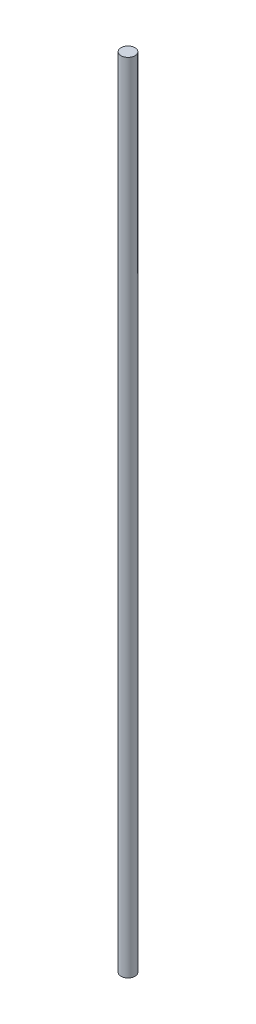
ISO-10303-21;
HEADER;
FILE_DESCRIPTION(('STEP AP214'),'2;1');
FILE_NAME('part.step','',(''),(''),'','','');
FILE_SCHEMA(('AUTOMOTIVE_DESIGN { 1 0 10303 214 1 1 1 1 }'));
ENDSEC;
DATA;
#1=APPLICATION_CONTEXT('core data for automotive mechanical design processes');
#2=APPLICATION_PROTOCOL_DEFINITION('international standard','automotive_design',2000,#1);
#3=PRODUCT_CONTEXT('',#1,'mechanical');
#4=PRODUCT('Part','Part','',(#3));
#5=PRODUCT_RELATED_PRODUCT_CATEGORY('part','',(#4));
#6=PRODUCT_DEFINITION_FORMATION('','',#4);
#7=PRODUCT_DEFINITION_CONTEXT('part definition',#1,'design');
#8=PRODUCT_DEFINITION('design','',#6,#7);
#9=PRODUCT_DEFINITION_SHAPE('','',#8);
#10=(LENGTH_UNIT() NAMED_UNIT(*) SI_UNIT(.MILLI.,.METRE.));
#11=(NAMED_UNIT(*) PLANE_ANGLE_UNIT() SI_UNIT($,.RADIAN.));
#12=(NAMED_UNIT(*) SI_UNIT($,.STERADIAN.) SOLID_ANGLE_UNIT());
#13=UNCERTAINTY_MEASURE_WITH_UNIT(LENGTH_MEASURE(1.E-05),#10,'distance_accuracy_value','');
#14=(GEOMETRIC_REPRESENTATION_CONTEXT(3) GLOBAL_UNCERTAINTY_ASSIGNED_CONTEXT((#13)) GLOBAL_UNIT_ASSIGNED_CONTEXT((#10,
#11,#12)) REPRESENTATION_CONTEXT('',''));
#15=CARTESIAN_POINT('',(0.,0.,0.));
#16=DIRECTION('',(0.,0.,1.));
#17=DIRECTION('',(1.,0.,0.));
#18=AXIS2_PLACEMENT_3D('',#15,#16,#17);
#19=CARTESIAN_POINT('',(0.,100.,0.));
#20=DIRECTION('',(0.,-1.,0.));
#21=DIRECTION('',(0.,0.,1.));
#22=AXIS2_PLACEMENT_3D('',#19,#20,#21);
#23=CYLINDRICAL_SURFACE('',#22,0.875);
#24=CARTESIAN_POINT('',(0.,100.,0.));
#25=DIRECTION('',(0.,-1.,0.));
#26=DIRECTION('',(0.,0.,-1.));
#27=AXIS2_PLACEMENT_3D('',#24,#25,#26);
#28=CIRCLE('',#27,0.875);
#29=CARTESIAN_POINT('',(0.,100.,-0.875));
#30=VERTEX_POINT('',#29);
#31=EDGE_CURVE('E10',#30,#30,#28,.T.);
#32=ORIENTED_EDGE('',*,*,#31,.T.);
#33=EDGE_LOOP('',(#32));
#34=FACE_BOUND('',#33,.T.);
#35=CARTESIAN_POINT('',(0.,0.,0.));
#36=DIRECTION('',(0.,-1.,0.));
#37=DIRECTION('',(0.,0.,-1.));
#38=AXIS2_PLACEMENT_3D('',#35,#36,#37);
#39=CIRCLE('',#38,0.875);
#40=CARTESIAN_POINT('',(0.,0.,-0.875));
#41=VERTEX_POINT('',#40);
#42=EDGE_CURVE('E36',#41,#41,#39,.T.);
#43=ORIENTED_EDGE('',*,*,#42,.F.);
#44=EDGE_LOOP('',(#43));
#45=FACE_BOUND('',#44,.T.);
#46=ADVANCED_FACE('F33',(#34,#45),#23,.T.);
#47=CARTESIAN_POINT('',(0.,100.,0.));
#48=DIRECTION('',(0.,1.,0.));
#49=DIRECTION('',(0.,0.,-1.));
#50=AXIS2_PLACEMENT_3D('',#47,#48,#49);
#51=PLANE('',#50);
#52=ORIENTED_EDGE('',*,*,#31,.F.);
#53=EDGE_LOOP('',(#52));
#54=FACE_BOUND('',#53,.T.);
#55=ADVANCED_FACE('F48',(#54),#51,.T.);
#56=CARTESIAN_POINT('',(0.,0.,0.));
#57=DIRECTION('',(0.,1.,0.));
#58=DIRECTION('',(0.,0.,-1.));
#59=AXIS2_PLACEMENT_3D('',#56,#57,#58);
#60=PLANE('',#59);
#61=ORIENTED_EDGE('',*,*,#42,.T.);
#62=EDGE_LOOP('',(#61));
#63=FACE_BOUND('',#62,.T.);
#64=ADVANCED_FACE('F45',(#63),#60,.F.);
#65=CLOSED_SHELL('',(#46,#55,#64));
#66=MANIFOLD_SOLID_BREP('B2',#65);
#67=ADVANCED_BREP_SHAPE_REPRESENTATION('',(#18,#66),#14);
#68=SHAPE_DEFINITION_REPRESENTATION(#9,#67);
ENDSEC;
END-ISO-10303-21;
